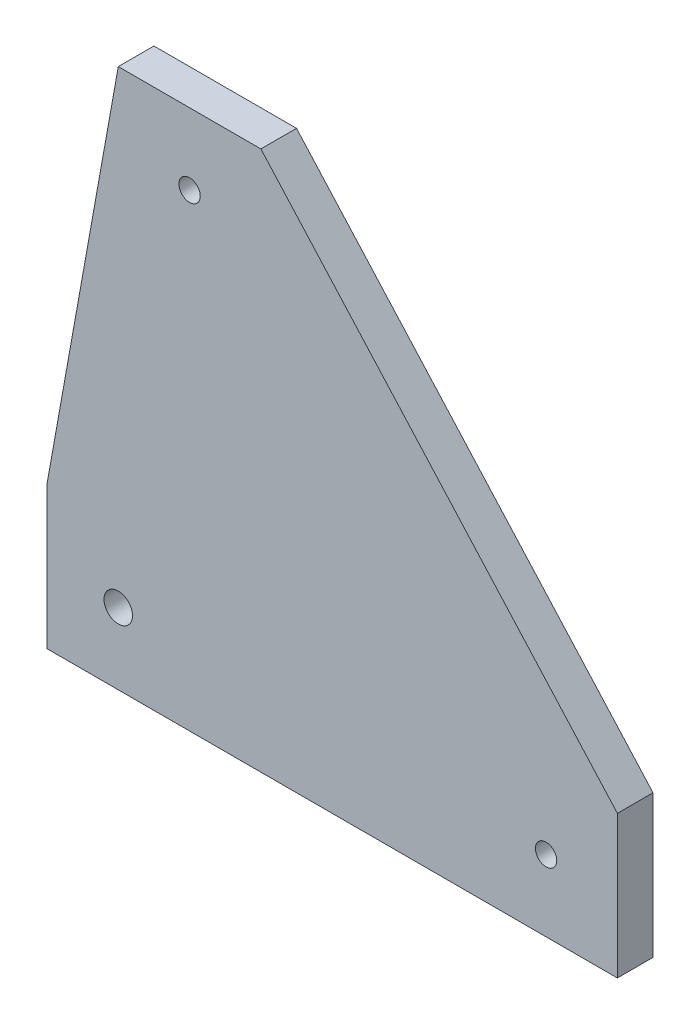
ISO-10303-21;
HEADER;
FILE_DESCRIPTION(('STEP AP214'),'2;1');
FILE_NAME('part.step','',(''),(''),'','','');
FILE_SCHEMA(('AUTOMOTIVE_DESIGN { 1 0 10303 214 1 1 1 1 }'));
ENDSEC;
DATA;
#1=APPLICATION_CONTEXT('core data for automotive mechanical design processes');
#2=APPLICATION_PROTOCOL_DEFINITION('international standard','automotive_design',2000,#1);
#3=PRODUCT_CONTEXT('',#1,'mechanical');
#4=PRODUCT('Part','Part','',(#3));
#5=PRODUCT_RELATED_PRODUCT_CATEGORY('part','',(#4));
#6=PRODUCT_DEFINITION_FORMATION('','',#4);
#7=PRODUCT_DEFINITION_CONTEXT('part definition',#1,'design');
#8=PRODUCT_DEFINITION('design','',#6,#7);
#9=PRODUCT_DEFINITION_SHAPE('','',#8);
#10=(LENGTH_UNIT() NAMED_UNIT(*) SI_UNIT(.MILLI.,.METRE.));
#11=(NAMED_UNIT(*) PLANE_ANGLE_UNIT() SI_UNIT($,.RADIAN.));
#12=(NAMED_UNIT(*) SI_UNIT($,.STERADIAN.) SOLID_ANGLE_UNIT());
#13=UNCERTAINTY_MEASURE_WITH_UNIT(LENGTH_MEASURE(1.E-05),#10,'distance_accuracy_value','');
#14=(GEOMETRIC_REPRESENTATION_CONTEXT(3) GLOBAL_UNCERTAINTY_ASSIGNED_CONTEXT((#13)) GLOBAL_UNIT_ASSIGNED_CONTEXT((#10,
#11,#12)) REPRESENTATION_CONTEXT('',''));
#15=CARTESIAN_POINT('',(0.,0.,0.));
#16=DIRECTION('',(0.,0.,1.));
#17=DIRECTION('',(1.,0.,0.));
#18=AXIS2_PLACEMENT_3D('',#15,#16,#17);
#19=CARTESIAN_POINT('',(0.,0.,5.));
#20=DIRECTION('',(0.,0.,-1.));
#21=DIRECTION('',(-1.,0.,0.));
#22=AXIS2_PLACEMENT_3D('',#19,#20,#21);
#23=PLANE('',#22);
#24=DIRECTION('',(-0.17668874685439,-0.984266776201973,0.));
#25=VECTOR('',#24,1.);
#26=CARTESIAN_POINT('',(-36.9154129306326,10.,5.));
#27=LINE('',#26,#25);
#28=CARTESIAN_POINT('',(-26.9154129306326,65.7062514577181,5.));
#29=VERTEX_POINT('',#28);
#30=CARTESIAN_POINT('',(-36.9154129306326,10.,5.));
#31=VERTEX_POINT('',#30);
#32=EDGE_CURVE('E129',#29,#31,#27,.T.);
#33=ORIENTED_EDGE('',*,*,#32,.T.);
#34=DIRECTION('',(0.,-1.,0.));
#35=VECTOR('',#34,1.);
#36=CARTESIAN_POINT('',(-36.9154129306326,-10.,5.));
#37=LINE('',#36,#35);
#38=CARTESIAN_POINT('',(-36.9154129306326,-10.,5.));
#39=VERTEX_POINT('',#38);
#40=EDGE_CURVE('E87',#31,#39,#37,.T.);
#41=ORIENTED_EDGE('',*,*,#40,.T.);
#42=DIRECTION('',(1.,0.,0.));
#43=VECTOR('',#42,1.);
#44=CARTESIAN_POINT('',(-36.9154129306326,-10.,5.));
#45=LINE('',#44,#43);
#46=CARTESIAN_POINT('',(43.0845870693674,-10.,5.));
#47=VERTEX_POINT('',#46);
#48=EDGE_CURVE('E100',#39,#47,#45,.T.);
#49=ORIENTED_EDGE('',*,*,#48,.T.);
#50=DIRECTION('',(0.,1.,0.));
#51=VECTOR('',#50,1.);
#52=CARTESIAN_POINT('',(43.0845870693674,-10.,5.));
#53=LINE('',#52,#51);
#54=CARTESIAN_POINT('',(43.0845870693674,10.,5.));
#55=VERTEX_POINT('',#54);
#56=EDGE_CURVE('E94',#47,#55,#53,.T.);
#57=ORIENTED_EDGE('',*,*,#56,.T.);
#58=DIRECTION('',(-0.667963093237091,0.744194400726811,0.));
#59=VECTOR('',#58,1.);
#60=CARTESIAN_POINT('',(-6.91541293063257,65.7062514577181,5.));
#61=LINE('',#60,#59);
#62=CARTESIAN_POINT('',(-6.91541293063257,65.7062514577181,5.));
#63=VERTEX_POINT('',#62);
#64=EDGE_CURVE('E98',#55,#63,#61,.T.);
#65=ORIENTED_EDGE('',*,*,#64,.T.);
#66=DIRECTION('',(-1.,0.,0.));
#67=VECTOR('',#66,1.);
#68=CARTESIAN_POINT('',(-26.9154129306326,65.7062514577181,5.));
#69=LINE('',#68,#67);
#70=EDGE_CURVE('E50',#63,#29,#69,.T.);
#71=ORIENTED_EDGE('',*,*,#70,.T.);
#72=EDGE_LOOP('',(#33,#41,#49,#57,#65,#71));
#73=FACE_BOUND('',#72,.T.);
#74=CARTESIAN_POINT('',(-26.9154129306326,0.,5.));
#75=DIRECTION('',(0.,0.,1.));
#76=DIRECTION('',(1.,0.,0.));
#77=AXIS2_PLACEMENT_3D('',#74,#75,#76);
#78=CIRCLE('',#77,2.);
#79=CARTESIAN_POINT('',(-24.9154129306326,0.,5.));
#80=VERTEX_POINT('',#79);
#81=EDGE_CURVE('E122',#80,#80,#78,.T.);
#82=ORIENTED_EDGE('',*,*,#81,.F.);
#83=EDGE_LOOP('',(#82));
#84=FACE_BOUND('',#83,.T.);
#85=CARTESIAN_POINT('',(33.0845870693674,0.,5.));
#86=DIRECTION('',(0.,0.,1.));
#87=DIRECTION('',(1.,0.,0.));
#88=AXIS2_PLACEMENT_3D('',#85,#86,#87);
#89=CIRCLE('',#88,1.5);
#90=CARTESIAN_POINT('',(34.5845870693674,0.,5.));
#91=VERTEX_POINT('',#90);
#92=EDGE_CURVE('E183',#91,#91,#89,.T.);
#93=ORIENTED_EDGE('',*,*,#92,.F.);
#94=EDGE_LOOP('',(#93));
#95=FACE_BOUND('',#94,.T.);
#96=CARTESIAN_POINT('',(-16.9154129306326,55.7062514577181,5.));
#97=DIRECTION('',(0.,0.,1.));
#98=DIRECTION('',(1.,0.,0.));
#99=AXIS2_PLACEMENT_3D('',#96,#97,#98);
#100=CIRCLE('',#99,1.5);
#101=CARTESIAN_POINT('',(-15.4154129306326,55.7062514577181,5.));
#102=VERTEX_POINT('',#101);
#103=EDGE_CURVE('E174',#102,#102,#100,.T.);
#104=ORIENTED_EDGE('',*,*,#103,.F.);
#105=EDGE_LOOP('',(#104));
#106=FACE_BOUND('',#105,.T.);
#107=ADVANCED_FACE('F33',(#73,#84,#95,#106),#23,.F.);
#108=CARTESIAN_POINT('',(0.,0.,0.));
#109=DIRECTION('',(0.,0.,-1.));
#110=DIRECTION('',(-1.,0.,0.));
#111=AXIS2_PLACEMENT_3D('',#108,#109,#110);
#112=PLANE('',#111);
#113=CARTESIAN_POINT('',(33.0845870693674,0.,0.));
#114=DIRECTION('',(0.,0.,1.));
#115=DIRECTION('',(1.,0.,0.));
#116=AXIS2_PLACEMENT_3D('',#113,#114,#115);
#117=CIRCLE('',#116,1.5);
#118=CARTESIAN_POINT('',(34.5845870693674,0.,0.));
#119=VERTEX_POINT('',#118);
#120=EDGE_CURVE('E180',#119,#119,#117,.T.);
#121=ORIENTED_EDGE('',*,*,#120,.T.);
#122=EDGE_LOOP('',(#121));
#123=FACE_BOUND('',#122,.T.);
#124=DIRECTION('',(-0.17668874685439,-0.984266776201973,0.));
#125=VECTOR('',#124,1.);
#126=CARTESIAN_POINT('',(-36.9154129306326,10.,0.));
#127=LINE('',#126,#125);
#128=CARTESIAN_POINT('',(-26.9154129306326,65.7062514577181,0.));
#129=VERTEX_POINT('',#128);
#130=CARTESIAN_POINT('',(-36.9154129306326,10.,0.));
#131=VERTEX_POINT('',#130);
#132=EDGE_CURVE('E118',#129,#131,#127,.T.);
#133=ORIENTED_EDGE('',*,*,#132,.F.);
#134=DIRECTION('',(-1.,0.,0.));
#135=VECTOR('',#134,1.);
#136=CARTESIAN_POINT('',(-26.9154129306326,65.7062514577181,0.));
#137=LINE('',#136,#135);
#138=CARTESIAN_POINT('',(-6.91541293063257,65.7062514577181,0.));
#139=VERTEX_POINT('',#138);
#140=EDGE_CURVE('E79',#139,#129,#137,.T.);
#141=ORIENTED_EDGE('',*,*,#140,.F.);
#142=DIRECTION('',(-0.667963093237091,0.744194400726811,0.));
#143=VECTOR('',#142,1.);
#144=CARTESIAN_POINT('',(-6.91541293063257,65.7062514577181,0.));
#145=LINE('',#144,#143);
#146=CARTESIAN_POINT('',(43.0845870693674,10.,0.));
#147=VERTEX_POINT('',#146);
#148=EDGE_CURVE('E73',#147,#139,#145,.T.);
#149=ORIENTED_EDGE('',*,*,#148,.F.);
#150=DIRECTION('',(0.,1.,0.));
#151=VECTOR('',#150,1.);
#152=CARTESIAN_POINT('',(43.0845870693674,-10.,0.));
#153=LINE('',#152,#151);
#154=CARTESIAN_POINT('',(43.0845870693674,-10.,0.));
#155=VERTEX_POINT('',#154);
#156=EDGE_CURVE('E108',#155,#147,#153,.T.);
#157=ORIENTED_EDGE('',*,*,#156,.F.);
#158=DIRECTION('',(1.,0.,0.));
#159=VECTOR('',#158,1.);
#160=CARTESIAN_POINT('',(-36.9154129306326,-10.,0.));
#161=LINE('',#160,#159);
#162=CARTESIAN_POINT('',(-36.9154129306326,-10.,0.));
#163=VERTEX_POINT('',#162);
#164=EDGE_CURVE('E124',#163,#155,#161,.T.);
#165=ORIENTED_EDGE('',*,*,#164,.F.);
#166=DIRECTION('',(0.,-1.,0.));
#167=VECTOR('',#166,1.);
#168=CARTESIAN_POINT('',(-36.9154129306326,-10.,0.));
#169=LINE('',#168,#167);
#170=EDGE_CURVE('E121',#131,#163,#169,.T.);
#171=ORIENTED_EDGE('',*,*,#170,.F.);
#172=EDGE_LOOP('',(#133,#141,#149,#157,#165,#171));
#173=FACE_BOUND('',#172,.T.);
#174=CARTESIAN_POINT('',(-26.9154129306326,0.,0.));
#175=DIRECTION('',(0.,0.,1.));
#176=DIRECTION('',(1.,0.,0.));
#177=AXIS2_PLACEMENT_3D('',#174,#175,#176);
#178=CIRCLE('',#177,2.);
#179=CARTESIAN_POINT('',(-24.9154129306326,0.,0.));
#180=VERTEX_POINT('',#179);
#181=EDGE_CURVE('E186',#180,#180,#178,.T.);
#182=ORIENTED_EDGE('',*,*,#181,.T.);
#183=EDGE_LOOP('',(#182));
#184=FACE_BOUND('',#183,.T.);
#185=CARTESIAN_POINT('',(-16.9154129306326,55.7062514577181,0.));
#186=DIRECTION('',(0.,0.,1.));
#187=DIRECTION('',(1.,0.,0.));
#188=AXIS2_PLACEMENT_3D('',#185,#186,#187);
#189=CIRCLE('',#188,1.5);
#190=CARTESIAN_POINT('',(-15.4154129306326,55.7062514577181,0.));
#191=VERTEX_POINT('',#190);
#192=EDGE_CURVE('E177',#191,#191,#189,.T.);
#193=ORIENTED_EDGE('',*,*,#192,.T.);
#194=EDGE_LOOP('',(#193));
#195=FACE_BOUND('',#194,.T.);
#196=ADVANCED_FACE('F138',(#123,#173,#184,#195),#112,.T.);
#197=CARTESIAN_POINT('',(-36.9154129306326,10.,5.));
#198=DIRECTION('',(0.984266776201973,-0.17668874685439,0.));
#199=DIRECTION('',(0.17668874685439,0.984266776201973,0.));
#200=AXIS2_PLACEMENT_3D('',#197,#198,#199);
#201=PLANE('',#200);
#202=ORIENTED_EDGE('',*,*,#132,.T.);
#203=DIRECTION('',(0.,0.,-1.));
#204=VECTOR('',#203,1.);
#205=CARTESIAN_POINT('',(-36.9154129306326,10.,5.));
#206=LINE('',#205,#204);
#207=EDGE_CURVE('E11',#31,#131,#206,.T.);
#208=ORIENTED_EDGE('',*,*,#207,.F.);
#209=ORIENTED_EDGE('',*,*,#32,.F.);
#210=DIRECTION('',(0.,0.,-1.));
#211=VECTOR('',#210,1.);
#212=CARTESIAN_POINT('',(-26.9154129306326,65.7062514577181,5.));
#213=LINE('',#212,#211);
#214=EDGE_CURVE('E114',#29,#129,#213,.T.);
#215=ORIENTED_EDGE('',*,*,#214,.T.);
#216=EDGE_LOOP('',(#202,#208,#209,#215));
#217=FACE_BOUND('',#216,.T.);
#218=ADVANCED_FACE('F35',(#217),#201,.F.);
#219=CARTESIAN_POINT('',(-36.9154129306326,-10.,5.));
#220=DIRECTION('',(1.,0.,0.));
#221=DIRECTION('',(0.,0.,-1.));
#222=AXIS2_PLACEMENT_3D('',#219,#220,#221);
#223=PLANE('',#222);
#224=ORIENTED_EDGE('',*,*,#170,.T.);
#225=DIRECTION('',(0.,0.,-1.));
#226=VECTOR('',#225,1.);
#227=CARTESIAN_POINT('',(-36.9154129306326,-10.,5.));
#228=LINE('',#227,#226);
#229=EDGE_CURVE('E42',#39,#163,#228,.T.);
#230=ORIENTED_EDGE('',*,*,#229,.F.);
#231=ORIENTED_EDGE('',*,*,#40,.F.);
#232=ORIENTED_EDGE('',*,*,#207,.T.);
#233=EDGE_LOOP('',(#224,#230,#231,#232));
#234=FACE_BOUND('',#233,.T.);
#235=ADVANCED_FACE('F237',(#234),#223,.F.);
#236=CARTESIAN_POINT('',(-36.9154129306326,-10.,5.));
#237=DIRECTION('',(0.,1.,0.));
#238=DIRECTION('',(0.,0.,1.));
#239=AXIS2_PLACEMENT_3D('',#236,#237,#238);
#240=PLANE('',#239);
#241=ORIENTED_EDGE('',*,*,#164,.T.);
#242=DIRECTION('',(0.,0.,-1.));
#243=VECTOR('',#242,1.);
#244=CARTESIAN_POINT('',(43.0845870693674,-10.,5.));
#245=LINE('',#244,#243);
#246=EDGE_CURVE('E109',#47,#155,#245,.T.);
#247=ORIENTED_EDGE('',*,*,#246,.F.);
#248=ORIENTED_EDGE('',*,*,#48,.F.);
#249=ORIENTED_EDGE('',*,*,#229,.T.);
#250=EDGE_LOOP('',(#241,#247,#248,#249));
#251=FACE_BOUND('',#250,.T.);
#252=ADVANCED_FACE('F135',(#251),#240,.F.);
#253=CARTESIAN_POINT('',(43.0845870693674,-10.,5.));
#254=DIRECTION('',(-1.,0.,0.));
#255=DIRECTION('',(0.,0.,1.));
#256=AXIS2_PLACEMENT_3D('',#253,#254,#255);
#257=PLANE('',#256);
#258=ORIENTED_EDGE('',*,*,#156,.T.);
#259=DIRECTION('',(0.,0.,-1.));
#260=VECTOR('',#259,1.);
#261=CARTESIAN_POINT('',(43.0845870693674,10.,5.));
#262=LINE('',#261,#260);
#263=EDGE_CURVE('E105',#55,#147,#262,.T.);
#264=ORIENTED_EDGE('',*,*,#263,.F.);
#265=ORIENTED_EDGE('',*,*,#56,.F.);
#266=ORIENTED_EDGE('',*,*,#246,.T.);
#267=EDGE_LOOP('',(#258,#264,#265,#266));
#268=FACE_BOUND('',#267,.T.);
#269=ADVANCED_FACE('F106',(#268),#257,.F.);
#270=CARTESIAN_POINT('',(-6.91541293063257,65.7062514577181,5.));
#271=DIRECTION('',(-0.744194400726811,-0.667963093237091,0.));
#272=DIRECTION('',(0.667963093237091,-0.744194400726811,0.));
#273=AXIS2_PLACEMENT_3D('',#270,#271,#272);
#274=PLANE('',#273);
#275=ORIENTED_EDGE('',*,*,#148,.T.);
#276=DIRECTION('',(0.,0.,-1.));
#277=VECTOR('',#276,1.);
#278=CARTESIAN_POINT('',(-6.91541293063257,65.7062514577181,5.));
#279=LINE('',#278,#277);
#280=EDGE_CURVE('E110',#63,#139,#279,.T.);
#281=ORIENTED_EDGE('',*,*,#280,.F.);
#282=ORIENTED_EDGE('',*,*,#64,.F.);
#283=ORIENTED_EDGE('',*,*,#263,.T.);
#284=EDGE_LOOP('',(#275,#281,#282,#283));
#285=FACE_BOUND('',#284,.T.);
#286=ADVANCED_FACE('F112',(#285),#274,.F.);
#287=CARTESIAN_POINT('',(-26.9154129306326,65.7062514577181,5.));
#288=DIRECTION('',(0.,-1.,0.));
#289=DIRECTION('',(0.,0.,-1.));
#290=AXIS2_PLACEMENT_3D('',#287,#288,#289);
#291=PLANE('',#290);
#292=ORIENTED_EDGE('',*,*,#140,.T.);
#293=ORIENTED_EDGE('',*,*,#214,.F.);
#294=ORIENTED_EDGE('',*,*,#70,.F.);
#295=ORIENTED_EDGE('',*,*,#280,.T.);
#296=EDGE_LOOP('',(#292,#293,#294,#295));
#297=FACE_BOUND('',#296,.T.);
#298=ADVANCED_FACE('F143',(#297),#291,.F.);
#299=CARTESIAN_POINT('',(-26.9154129306326,0.,5.));
#300=DIRECTION('',(0.,0.,-1.));
#301=DIRECTION('',(-1.,0.,0.));
#302=AXIS2_PLACEMENT_3D('',#299,#300,#301);
#303=CYLINDRICAL_SURFACE('',#302,2.);
#304=ORIENTED_EDGE('',*,*,#81,.T.);
#305=EDGE_LOOP('',(#304));
#306=FACE_BOUND('',#305,.T.);
#307=ORIENTED_EDGE('',*,*,#181,.F.);
#308=EDGE_LOOP('',(#307));
#309=FACE_BOUND('',#308,.T.);
#310=ADVANCED_FACE('F145',(#306,#309),#303,.F.);
#311=CARTESIAN_POINT('',(33.0845870693674,0.,5.));
#312=DIRECTION('',(0.,0.,-1.));
#313=DIRECTION('',(-1.,0.,0.));
#314=AXIS2_PLACEMENT_3D('',#311,#312,#313);
#315=CYLINDRICAL_SURFACE('',#314,1.5);
#316=ORIENTED_EDGE('',*,*,#92,.T.);
#317=EDGE_LOOP('',(#316));
#318=FACE_BOUND('',#317,.T.);
#319=ORIENTED_EDGE('',*,*,#120,.F.);
#320=EDGE_LOOP('',(#319));
#321=FACE_BOUND('',#320,.T.);
#322=ADVANCED_FACE('F151',(#318,#321),#315,.F.);
#323=CARTESIAN_POINT('',(-16.9154129306326,55.7062514577181,5.));
#324=DIRECTION('',(0.,0.,-1.));
#325=DIRECTION('',(-1.,0.,0.));
#326=AXIS2_PLACEMENT_3D('',#323,#324,#325);
#327=CYLINDRICAL_SURFACE('',#326,1.5);
#328=ORIENTED_EDGE('',*,*,#103,.T.);
#329=EDGE_LOOP('',(#328));
#330=FACE_BOUND('',#329,.T.);
#331=ORIENTED_EDGE('',*,*,#192,.F.);
#332=EDGE_LOOP('',(#331));
#333=FACE_BOUND('',#332,.T.);
#334=ADVANCED_FACE('F165',(#330,#333),#327,.F.);
#335=CLOSED_SHELL('',(#107,#196,#218,#235,#252,#269,#286,#298,#310,#322,#334));
#336=MANIFOLD_SOLID_BREP('B2',#335);
#337=ADVANCED_BREP_SHAPE_REPRESENTATION('',(#18,#336),#14);
#338=SHAPE_DEFINITION_REPRESENTATION(#9,#337);
ENDSEC;
END-ISO-10303-21;
